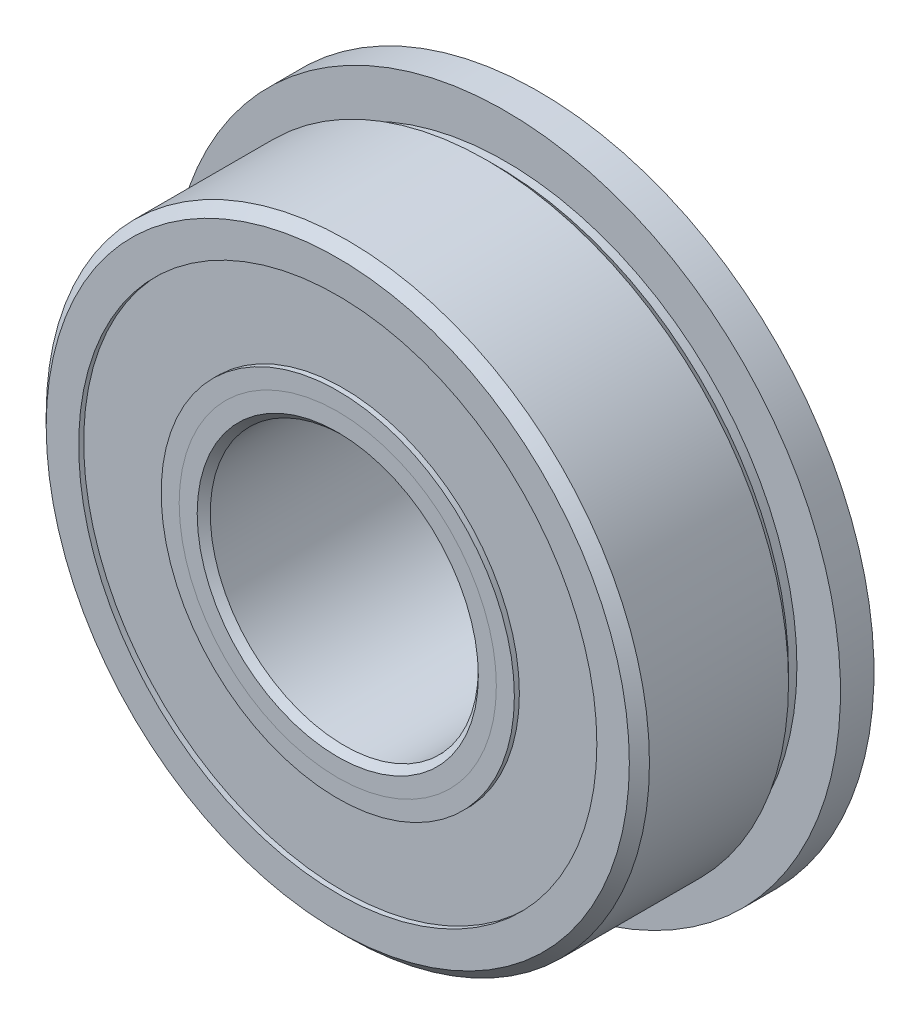
ISO-10303-21;
HEADER;
FILE_DESCRIPTION(('STEP AP214'),'2;1');
FILE_NAME('part.step','',(''),(''),'','','');
FILE_SCHEMA(('AUTOMOTIVE_DESIGN { 1 0 10303 214 1 1 1 1 }'));
ENDSEC;
DATA;
#1=APPLICATION_CONTEXT('core data for automotive mechanical design processes');
#2=APPLICATION_PROTOCOL_DEFINITION('international standard','automotive_design',2000,#1);
#3=PRODUCT_CONTEXT('',#1,'mechanical');
#4=PRODUCT('Part','Part','',(#3));
#5=PRODUCT_RELATED_PRODUCT_CATEGORY('part','',(#4));
#6=PRODUCT_DEFINITION_FORMATION('','',#4);
#7=PRODUCT_DEFINITION_CONTEXT('part definition',#1,'design');
#8=PRODUCT_DEFINITION('design','',#6,#7);
#9=PRODUCT_DEFINITION_SHAPE('','',#8);
#10=(LENGTH_UNIT() NAMED_UNIT(*) SI_UNIT(.MILLI.,.METRE.));
#11=(NAMED_UNIT(*) PLANE_ANGLE_UNIT() SI_UNIT($,.RADIAN.));
#12=(NAMED_UNIT(*) SI_UNIT($,.STERADIAN.) SOLID_ANGLE_UNIT());
#13=UNCERTAINTY_MEASURE_WITH_UNIT(LENGTH_MEASURE(1.E-05),#10,'distance_accuracy_value','');
#14=(GEOMETRIC_REPRESENTATION_CONTEXT(3) GLOBAL_UNCERTAINTY_ASSIGNED_CONTEXT((#13)) GLOBAL_UNIT_ASSIGNED_CONTEXT((#10,
#11,#12)) REPRESENTATION_CONTEXT('',''));
#15=CARTESIAN_POINT('',(0.,0.,0.));
#16=DIRECTION('',(0.,0.,1.));
#17=DIRECTION('',(1.,0.,0.));
#18=AXIS2_PLACEMENT_3D('',#15,#16,#17);
#19=CARTESIAN_POINT('',(0.,0.,4.7625));
#20=DIRECTION('',(0.,0.,1.));
#21=DIRECTION('',(1.,0.,0.));
#22=AXIS2_PLACEMENT_3D('',#19,#20,#21);
#23=CYLINDRICAL_SURFACE('',#22,8.7376);
#24=CARTESIAN_POINT('',(0.,0.,-3.35017734788581));
#25=DIRECTION('',(0.,0.,1.));
#26=DIRECTION('',(1.,0.,0.));
#27=AXIS2_PLACEMENT_3D('',#24,#25,#26);
#28=CIRCLE('',#27,8.7376);
#29=CARTESIAN_POINT('',(8.7376,0.,-3.35017734788581));
#30=VERTEX_POINT('',#29);
#31=EDGE_CURVE('E11',#30,#30,#28,.T.);
#32=ORIENTED_EDGE('',*,*,#31,.T.);
#33=EDGE_LOOP('',(#32));
#34=FACE_BOUND('',#33,.T.);
#35=CARTESIAN_POINT('',(0.,0.,-4.270375));
#36=DIRECTION('',(0.,0.,-1.));
#37=DIRECTION('',(-1.,0.,0.));
#38=AXIS2_PLACEMENT_3D('',#35,#36,#37);
#39=CIRCLE('',#38,8.7376);
#40=CARTESIAN_POINT('',(-8.7376,0.,-4.270375));
#41=VERTEX_POINT('',#40);
#42=EDGE_CURVE('E71',#41,#41,#39,.T.);
#43=ORIENTED_EDGE('',*,*,#42,.T.);
#44=EDGE_LOOP('',(#43));
#45=FACE_BOUND('',#44,.T.);
#46=ADVANCED_FACE('F50',(#34,#45),#23,.F.);
#47=CARTESIAN_POINT('',(0.,12.2725961538462,-4.524375));
#48=DIRECTION('',(0.,0.,1.));
#49=DIRECTION('',(1.,0.,0.));
#50=AXIS2_PLACEMENT_3D('',#47,#48,#49);
#51=PLANE('',#50);
#52=CARTESIAN_POINT('',(0.,0.,-4.524375));
#53=DIRECTION('',(0.,0.,-1.));
#54=DIRECTION('',(-1.,0.,0.));
#55=AXIS2_PLACEMENT_3D('',#52,#53,#54);
#56=CIRCLE('',#55,9.436608);
#57=CARTESIAN_POINT('',(-9.436608,0.,-4.524375));
#58=VERTEX_POINT('',#57);
#59=EDGE_CURVE('E68',#58,#58,#56,.T.);
#60=ORIENTED_EDGE('',*,*,#59,.F.);
#61=EDGE_LOOP('',(#60));
#62=FACE_BOUND('',#61,.T.);
#63=CARTESIAN_POINT('',(0.,0.,-4.524375));
#64=DIRECTION('',(0.,0.,1.));
#65=DIRECTION('',(1.,0.,0.));
#66=AXIS2_PLACEMENT_3D('',#63,#64,#65);
#67=CIRCLE('',#66,12.2725961538462);
#68=CARTESIAN_POINT('',(12.2725961538462,0.,-4.524375));
#69=VERTEX_POINT('',#68);
#70=EDGE_CURVE('E61',#69,#69,#67,.T.);
#71=ORIENTED_EDGE('',*,*,#70,.F.);
#72=EDGE_LOOP('',(#71));
#73=FACE_BOUND('',#72,.T.);
#74=ADVANCED_FACE('F52',(#62,#73),#51,.F.);
#75=CARTESIAN_POINT('',(0.,12.2725961538462,-3.35017734788581));
#76=DIRECTION('',(0.,0.,-1.));
#77=DIRECTION('',(-1.,0.,0.));
#78=AXIS2_PLACEMENT_3D('',#75,#76,#77);
#79=PLANE('',#78);
#80=ORIENTED_EDGE('',*,*,#31,.F.);
#81=EDGE_LOOP('',(#80));
#82=FACE_BOUND('',#81,.T.);
#83=CARTESIAN_POINT('',(0.,0.,-3.35017734788581));
#84=DIRECTION('',(0.,0.,1.));
#85=DIRECTION('',(1.,0.,0.));
#86=AXIS2_PLACEMENT_3D('',#83,#84,#85);
#87=CIRCLE('',#86,12.2725961538462);
#88=CARTESIAN_POINT('',(12.2725961538462,0.,-3.35017734788581));
#89=VERTEX_POINT('',#88);
#90=EDGE_CURVE('E57',#89,#89,#87,.T.);
#91=ORIENTED_EDGE('',*,*,#90,.T.);
#92=EDGE_LOOP('',(#91));
#93=FACE_BOUND('',#92,.T.);
#94=ADVANCED_FACE('F93',(#82,#93),#79,.F.);
#95=CARTESIAN_POINT('',(0.,0.,4.7625));
#96=DIRECTION('',(0.,0.,1.));
#97=DIRECTION('',(1.,0.,0.));
#98=AXIS2_PLACEMENT_3D('',#95,#96,#97);
#99=CYLINDRICAL_SURFACE('',#98,12.2725961538462);
#100=ORIENTED_EDGE('',*,*,#90,.F.);
#101=EDGE_LOOP('',(#100));
#102=FACE_BOUND('',#101,.T.);
#103=ORIENTED_EDGE('',*,*,#70,.T.);
#104=EDGE_LOOP('',(#103));
#105=FACE_BOUND('',#104,.T.);
#106=ADVANCED_FACE('F87',(#102,#105),#99,.T.);
#107=CARTESIAN_POINT('',(0.,0.,-4.270375));
#108=DIRECTION('',(0.,0.,-1.));
#109=DIRECTION('',(-1.,0.,0.));
#110=AXIS2_PLACEMENT_3D('',#107,#108,#109);
#111=CYLINDRICAL_SURFACE('',#110,9.436608);
#112=CARTESIAN_POINT('',(0.,0.,-4.270375));
#113=DIRECTION('',(0.,0.,-1.));
#114=DIRECTION('',(-1.,0.,0.));
#115=AXIS2_PLACEMENT_3D('',#112,#113,#114);
#116=CIRCLE('',#115,9.436608);
#117=CARTESIAN_POINT('',(-9.436608,0.,-4.270375));
#118=VERTEX_POINT('',#117);
#119=EDGE_CURVE('E65',#118,#118,#116,.T.);
#120=ORIENTED_EDGE('',*,*,#119,.F.);
#121=EDGE_LOOP('',(#120));
#122=FACE_BOUND('',#121,.T.);
#123=ORIENTED_EDGE('',*,*,#59,.T.);
#124=EDGE_LOOP('',(#123));
#125=FACE_BOUND('',#124,.T.);
#126=ADVANCED_FACE('F81',(#122,#125),#111,.F.);
#127=CARTESIAN_POINT('',(0.,0.,-4.270375));
#128=DIRECTION('',(0.,0.,-1.));
#129=DIRECTION('',(-1.,0.,0.));
#130=AXIS2_PLACEMENT_3D('',#127,#128,#129);
#131=PLANE('',#130);
#132=ORIENTED_EDGE('',*,*,#42,.F.);
#133=EDGE_LOOP('',(#132));
#134=FACE_BOUND('',#133,.T.);
#135=ORIENTED_EDGE('',*,*,#119,.T.);
#136=EDGE_LOOP('',(#135));
#137=FACE_BOUND('',#136,.T.);
#138=ADVANCED_FACE('F78',(#134,#137),#131,.T.);
#139=CLOSED_SHELL('',(#46,#74,#94,#106,#126,#138));
#140=MANIFOLD_SOLID_BREP('B2',#139);
#141=CARTESIAN_POINT('',(0.,12.2725961538462,4.524375));
#142=DIRECTION('',(0.,0.,-1.));
#143=DIRECTION('',(-1.,0.,0.));
#144=AXIS2_PLACEMENT_3D('',#141,#142,#143);
#145=PLANE('',#144);
#146=CARTESIAN_POINT('',(0.,0.,4.524375));
#147=DIRECTION('',(0.,0.,1.));
#148=DIRECTION('',(1.,0.,0.));
#149=AXIS2_PLACEMENT_3D('',#146,#147,#148);
#150=CIRCLE('',#149,8.36490384615385);
#151=CARTESIAN_POINT('',(8.36490384615385,0.,4.524375));
#152=VERTEX_POINT('',#151);
#153=EDGE_CURVE('E49',#152,#152,#150,.T.);
#154=ORIENTED_EDGE('',*,*,#153,.F.);
#155=EDGE_LOOP('',(#154));
#156=FACE_BOUND('',#155,.T.);
#157=CARTESIAN_POINT('',(0.,0.,4.524375));
#158=DIRECTION('',(0.,0.,1.));
#159=DIRECTION('',(1.,0.,0.));
#160=AXIS2_PLACEMENT_3D('',#157,#158,#159);
#161=CIRCLE('',#160,12.2725961538462);
#162=CARTESIAN_POINT('',(12.2725961538462,0.,4.524375));
#163=VERTEX_POINT('',#162);
#164=EDGE_CURVE('E168',#163,#163,#161,.T.);
#165=ORIENTED_EDGE('',*,*,#164,.T.);
#166=EDGE_LOOP('',(#165));
#167=FACE_BOUND('',#166,.T.);
#168=ADVANCED_FACE('F154',(#156,#167),#145,.F.);
#169=CARTESIAN_POINT('',(0.,0.,4.7625));
#170=DIRECTION('',(0.,0.,1.));
#171=DIRECTION('',(1.,0.,0.));
#172=AXIS2_PLACEMENT_3D('',#169,#170,#171);
#173=CYLINDRICAL_SURFACE('',#172,8.36490384615385);
#174=CARTESIAN_POINT('',(0.,0.,3.3501773478858));
#175=DIRECTION('',(0.,0.,1.));
#176=DIRECTION('',(1.,0.,0.));
#177=AXIS2_PLACEMENT_3D('',#174,#175,#176);
#178=CIRCLE('',#177,8.36490384615385);
#179=CARTESIAN_POINT('',(8.36490384615385,0.,3.3501773478858));
#180=VERTEX_POINT('',#179);
#181=EDGE_CURVE('E160',#180,#180,#178,.T.);
#182=ORIENTED_EDGE('',*,*,#181,.F.);
#183=EDGE_LOOP('',(#182));
#184=FACE_BOUND('',#183,.T.);
#185=ORIENTED_EDGE('',*,*,#153,.T.);
#186=EDGE_LOOP('',(#185));
#187=FACE_BOUND('',#186,.T.);
#188=ADVANCED_FACE('F183',(#184,#187),#173,.F.);
#189=CARTESIAN_POINT('',(0.,12.2725961538462,3.3501773478858));
#190=DIRECTION('',(0.,0.,1.));
#191=DIRECTION('',(1.,0.,0.));
#192=AXIS2_PLACEMENT_3D('',#189,#190,#191);
#193=PLANE('',#192);
#194=CARTESIAN_POINT('',(0.,0.,3.35017734788581));
#195=DIRECTION('',(0.,0.,1.));
#196=DIRECTION('',(1.,0.,0.));
#197=AXIS2_PLACEMENT_3D('',#194,#195,#196);
#198=CIRCLE('',#197,12.2725961538462);
#199=CARTESIAN_POINT('',(12.2725961538462,0.,3.35017734788581));
#200=VERTEX_POINT('',#199);
#201=EDGE_CURVE('E164',#200,#200,#198,.T.);
#202=ORIENTED_EDGE('',*,*,#201,.F.);
#203=EDGE_LOOP('',(#202));
#204=FACE_BOUND('',#203,.T.);
#205=ORIENTED_EDGE('',*,*,#181,.T.);
#206=EDGE_LOOP('',(#205));
#207=FACE_BOUND('',#206,.T.);
#208=ADVANCED_FACE('F178',(#204,#207),#193,.F.);
#209=CARTESIAN_POINT('',(0.,0.,4.7625));
#210=DIRECTION('',(0.,0.,1.));
#211=DIRECTION('',(1.,0.,0.));
#212=AXIS2_PLACEMENT_3D('',#209,#210,#211);
#213=CYLINDRICAL_SURFACE('',#212,12.2725961538462);
#214=ORIENTED_EDGE('',*,*,#164,.F.);
#215=EDGE_LOOP('',(#214));
#216=FACE_BOUND('',#215,.T.);
#217=ORIENTED_EDGE('',*,*,#201,.T.);
#218=EDGE_LOOP('',(#217));
#219=FACE_BOUND('',#218,.T.);
#220=ADVANCED_FACE('F175',(#216,#219),#213,.T.);
#221=CLOSED_SHELL('',(#168,#188,#208,#220));
#222=MANIFOLD_SOLID_BREP('B6',#221);
#223=CARTESIAN_POINT('',(-5.15937499999989,8.93629963530074,0.));
#224=DIRECTION('',(0.,0.,1.));
#225=DIRECTION('',(-0.499999999999989,0.866025403784445,0.));
#226=AXIS2_PLACEMENT_3D('',#223,#224,#225);
#227=SPHERICAL_SURFACE('',#226,3.3501773478858);
#228=CARTESIAN_POINT('',(-5.15937499999989,8.93629963530074,3.3501773478858));
#229=VERTEX_POINT('',#228);
#230=VERTEX_LOOP('',#229);
#231=FACE_BOUND('',#230,.T.);
#232=ADVANCED_FACE('F214',(#231),#227,.T.);
#233=CLOSED_SHELL('',(#232));
#234=MANIFOLD_SOLID_BREP('B44',#233);
#235=CARTESIAN_POINT('',(-8.93629963530062,5.1593750000001,0.));
#236=DIRECTION('',(0.,0.,1.));
#237=DIRECTION('',(-0.866025403784433,0.50000000000001,0.));
#238=AXIS2_PLACEMENT_3D('',#235,#236,#237);
#239=SPHERICAL_SURFACE('',#238,3.3501773478858);
#240=CARTESIAN_POINT('',(-8.93629963530062,5.1593750000001,3.3501773478858));
#241=VERTEX_POINT('',#240);
#242=VERTEX_LOOP('',#241);
#243=FACE_BOUND('',#242,.T.);
#244=ADVANCED_FACE('F233',(#243),#239,.T.);
#245=CLOSED_SHELL('',(#244));
#246=MANIFOLD_SOLID_BREP('B150',#245);
#247=CARTESIAN_POINT('',(-10.31875,1.08083169195563E-13,0.));
#248=DIRECTION('',(0.,0.,1.));
#249=DIRECTION('',(-1.,0.,0.));
#250=AXIS2_PLACEMENT_3D('',#247,#248,#249);
#251=SPHERICAL_SURFACE('',#250,3.3501773478858);
#252=CARTESIAN_POINT('',(-10.31875,1.08083169195563E-13,3.3501773478858));
#253=VERTEX_POINT('',#252);
#254=VERTEX_LOOP('',#253);
#255=FACE_BOUND('',#254,.T.);
#256=ADVANCED_FACE('F252',(#255),#251,.T.);
#257=CLOSED_SHELL('',(#256));
#258=MANIFOLD_SOLID_BREP('B210',#257);
#259=CARTESIAN_POINT('',(-8.93629963530072,-5.15937499999992,0.));
#260=DIRECTION('',(0.,0.,1.));
#261=DIRECTION('',(-0.866025403784443,-0.499999999999992,0.));
#262=AXIS2_PLACEMENT_3D('',#259,#260,#261);
#263=SPHERICAL_SURFACE('',#262,3.3501773478858);
#264=CARTESIAN_POINT('',(-8.93629963530072,-5.15937499999992,3.3501773478858));
#265=VERTEX_POINT('',#264);
#266=VERTEX_LOOP('',#265);
#267=FACE_BOUND('',#266,.T.);
#268=ADVANCED_FACE('F271',(#267),#263,.T.);
#269=CLOSED_SHELL('',(#268));
#270=MANIFOLD_SOLID_BREP('B229',#269);
#271=CARTESIAN_POINT('',(-5.15937500000007,-8.93629963530064,0.));
#272=DIRECTION('',(0.,0.,1.));
#273=DIRECTION('',(-0.500000000000007,-0.866025403784435,0.));
#274=AXIS2_PLACEMENT_3D('',#271,#272,#273);
#275=SPHERICAL_SURFACE('',#274,3.3501773478858);
#276=CARTESIAN_POINT('',(-5.15937500000007,-8.93629963530064,3.3501773478858));
#277=VERTEX_POINT('',#276);
#278=VERTEX_LOOP('',#277);
#279=FACE_BOUND('',#278,.T.);
#280=ADVANCED_FACE('F290',(#279),#275,.T.);
#281=CLOSED_SHELL('',(#280));
#282=MANIFOLD_SOLID_BREP('B248',#281);
#283=CARTESIAN_POINT('',(0.,-10.31875,0.));
#284=DIRECTION('',(0.,0.,1.));
#285=DIRECTION('',(0.,-1.,0.));
#286=AXIS2_PLACEMENT_3D('',#283,#284,#285);
#287=SPHERICAL_SURFACE('',#286,3.3501773478858);
#288=CARTESIAN_POINT('',(0.,-10.31875,3.3501773478858));
#289=VERTEX_POINT('',#288);
#290=VERTEX_LOOP('',#289);
#291=FACE_BOUND('',#290,.T.);
#292=ADVANCED_FACE('F309',(#291),#287,.T.);
#293=CLOSED_SHELL('',(#292));
#294=MANIFOLD_SOLID_BREP('B267',#293);
#295=CARTESIAN_POINT('',(5.15937499999995,-8.93629963530071,0.));
#296=DIRECTION('',(0.,0.,1.));
#297=DIRECTION('',(0.499999999999995,-0.866025403784442,0.));
#298=AXIS2_PLACEMENT_3D('',#295,#296,#297);
#299=SPHERICAL_SURFACE('',#298,3.3501773478858);
#300=CARTESIAN_POINT('',(5.15937499999995,-8.93629963530071,3.3501773478858));
#301=VERTEX_POINT('',#300);
#302=VERTEX_LOOP('',#301);
#303=FACE_BOUND('',#302,.T.);
#304=ADVANCED_FACE('F328',(#303),#299,.T.);
#305=CLOSED_SHELL('',(#304));
#306=MANIFOLD_SOLID_BREP('B286',#305);
#307=CARTESIAN_POINT('',(8.93629963530065,-5.15937500000004,0.));
#308=DIRECTION('',(0.,0.,1.));
#309=DIRECTION('',(0.866025403784436,-0.500000000000004,0.));
#310=AXIS2_PLACEMENT_3D('',#307,#308,#309);
#311=SPHERICAL_SURFACE('',#310,3.3501773478858);
#312=CARTESIAN_POINT('',(8.93629963530065,-5.15937500000004,3.3501773478858));
#313=VERTEX_POINT('',#312);
#314=VERTEX_LOOP('',#313);
#315=FACE_BOUND('',#314,.T.);
#316=ADVANCED_FACE('F347',(#315),#311,.T.);
#317=CLOSED_SHELL('',(#316));
#318=MANIFOLD_SOLID_BREP('B305',#317);
#319=CARTESIAN_POINT('',(10.31875,0.,0.));
#320=DIRECTION('',(0.,0.,1.));
#321=DIRECTION('',(1.,0.,0.));
#322=AXIS2_PLACEMENT_3D('',#319,#320,#321);
#323=SPHERICAL_SURFACE('',#322,3.3501773478858);
#324=CARTESIAN_POINT('',(10.31875,0.,3.3501773478858));
#325=VERTEX_POINT('',#324);
#326=VERTEX_LOOP('',#325);
#327=FACE_BOUND('',#326,.T.);
#328=ADVANCED_FACE('F366',(#327),#323,.T.);
#329=CLOSED_SHELL('',(#328));
#330=MANIFOLD_SOLID_BREP('B324',#329);
#331=CARTESIAN_POINT('',(8.93629963530069,5.15937499999998,0.));
#332=DIRECTION('',(0.,0.,1.));
#333=DIRECTION('',(0.86602540378444,0.499999999999998,0.));
#334=AXIS2_PLACEMENT_3D('',#331,#332,#333);
#335=SPHERICAL_SURFACE('',#334,3.3501773478858);
#336=CARTESIAN_POINT('',(8.93629963530069,5.15937499999998,3.3501773478858));
#337=VERTEX_POINT('',#336);
#338=VERTEX_LOOP('',#337);
#339=FACE_BOUND('',#338,.T.);
#340=ADVANCED_FACE('F385',(#339),#335,.T.);
#341=CLOSED_SHELL('',(#340));
#342=MANIFOLD_SOLID_BREP('B343',#341);
#343=CARTESIAN_POINT('',(5.15937500000001,8.93629963530067,0.));
#344=DIRECTION('',(0.,0.,1.));
#345=DIRECTION('',(0.500000000000001,0.866025403784438,0.));
#346=AXIS2_PLACEMENT_3D('',#343,#344,#345);
#347=SPHERICAL_SURFACE('',#346,3.3501773478858);
#348=CARTESIAN_POINT('',(5.15937500000001,8.93629963530067,3.3501773478858));
#349=VERTEX_POINT('',#348);
#350=VERTEX_LOOP('',#349);
#351=FACE_BOUND('',#350,.T.);
#352=ADVANCED_FACE('F404',(#351),#347,.T.);
#353=CLOSED_SHELL('',(#352));
#354=MANIFOLD_SOLID_BREP('B362',#353);
#355=CARTESIAN_POINT('',(0.,10.31875,0.));
#356=DIRECTION('',(0.,0.,1.));
#357=DIRECTION('',(0.,1.,0.));
#358=AXIS2_PLACEMENT_3D('',#355,#356,#357);
#359=SPHERICAL_SURFACE('',#358,3.3501773478858);
#360=CARTESIAN_POINT('',(0.,10.31875,3.3501773478858));
#361=VERTEX_POINT('',#360);
#362=VERTEX_LOOP('',#361);
#363=FACE_BOUND('',#362,.T.);
#364=ADVANCED_FACE('F425',(#363),#359,.T.);
#365=CLOSED_SHELL('',(#364));
#366=MANIFOLD_SOLID_BREP('B381',#365);
#367=CARTESIAN_POINT('',(0.,6.82625,-6.35));
#368=DIRECTION('',(0.,0.,1.));
#369=DIRECTION('',(1.,0.,0.));
#370=AXIS2_PLACEMENT_3D('',#367,#368,#369);
#371=PLANE('',#370);
#372=CARTESIAN_POINT('',(0.,0.,-6.35));
#373=DIRECTION('',(0.,0.,1.));
#374=DIRECTION('',(1.,0.,0.));
#375=AXIS2_PLACEMENT_3D('',#372,#373,#374);
#376=CIRCLE('',#375,6.82625);
#377=CARTESIAN_POINT('',(6.82625,0.,-6.35));
#378=VERTEX_POINT('',#377);
#379=EDGE_CURVE('E470',#378,#378,#376,.T.);
#380=ORIENTED_EDGE('',*,*,#379,.T.);
#381=EDGE_LOOP('',(#380));
#382=FACE_BOUND('',#381,.T.);
#383=CARTESIAN_POINT('',(0.,0.,-6.35));
#384=DIRECTION('',(0.,0.,-1.));
#385=DIRECTION('',(-1.,0.,0.));
#386=AXIS2_PLACEMENT_3D('',#383,#384,#385);
#387=CIRCLE('',#386,7.607173);
#388=CARTESIAN_POINT('',(-7.607173,0.,-6.35));
#389=VERTEX_POINT('',#388);
#390=EDGE_CURVE('E489',#389,#389,#387,.T.);
#391=ORIENTED_EDGE('',*,*,#390,.T.);
#392=EDGE_LOOP('',(#391));
#393=FACE_BOUND('',#392,.T.);
#394=ADVANCED_FACE('F444',(#382,#393),#371,.F.);
#395=CARTESIAN_POINT('',(0.,7.51209508610547,4.7625));
#396=DIRECTION('',(0.,0.,-1.));
#397=DIRECTION('',(-1.,0.,0.));
#398=AXIS2_PLACEMENT_3D('',#395,#396,#397);
#399=PLANE('',#398);
#400=CARTESIAN_POINT('',(0.,0.,4.7625));
#401=DIRECTION('',(0.,0.,1.));
#402=DIRECTION('',(1.,0.,0.));
#403=AXIS2_PLACEMENT_3D('',#400,#401,#402);
#404=CIRCLE('',#403,6.6592863260571);
#405=CARTESIAN_POINT('',(6.6592863260571,0.,4.7625));
#406=VERTEX_POINT('',#405);
#407=EDGE_CURVE('E479',#406,#406,#404,.T.);
#408=ORIENTED_EDGE('',*,*,#407,.F.);
#409=EDGE_LOOP('',(#408));
#410=FACE_BOUND('',#409,.T.);
#411=CARTESIAN_POINT('',(0.,0.,4.7625));
#412=DIRECTION('',(0.,0.,1.));
#413=DIRECTION('',(1.,0.,0.));
#414=AXIS2_PLACEMENT_3D('',#411,#412,#413);
#415=CIRCLE('',#414,7.51209508610547);
#416=CARTESIAN_POINT('',(7.51209508610547,0.,4.7625));
#417=VERTEX_POINT('',#416);
#418=EDGE_CURVE('E424',#417,#417,#415,.T.);
#419=ORIENTED_EDGE('',*,*,#418,.T.);
#420=EDGE_LOOP('',(#419));
#421=FACE_BOUND('',#420,.T.);
#422=ADVANCED_FACE('F446',(#410,#421),#399,.F.);
#423=CARTESIAN_POINT('',(0.,0.,3.90969123995163));
#424=DIRECTION('',(0.,0.,1.));
#425=DIRECTION('',(1.,0.,0.));
#426=AXIS2_PLACEMENT_3D('',#423,#424,#425);
#427=CONICAL_SURFACE('',#426,6.6592863260571,0.785398163397449);
#428=ORIENTED_EDGE('',*,*,#418,.F.);
#429=EDGE_LOOP('',(#428));
#430=FACE_BOUND('',#429,.T.);
#431=CARTESIAN_POINT('',(0.,0.,3.90969123995163));
#432=DIRECTION('',(0.,0.,1.));
#433=DIRECTION('',(1.,0.,0.));
#434=AXIS2_PLACEMENT_3D('',#431,#432,#433);
#435=CIRCLE('',#434,6.6592863260571);
#436=CARTESIAN_POINT('',(6.6592863260571,0.,3.90969123995163));
#437=VERTEX_POINT('',#436);
#438=EDGE_CURVE('E451',#437,#437,#435,.T.);
#439=ORIENTED_EDGE('',*,*,#438,.T.);
#440=EDGE_LOOP('',(#439));
#441=FACE_BOUND('',#440,.T.);
#442=ADVANCED_FACE('F537',(#430,#441),#427,.T.);
#443=CARTESIAN_POINT('',(0.,0.,4.7625));
#444=DIRECTION('',(0.,0.,1.));
#445=DIRECTION('',(1.,0.,0.));
#446=AXIS2_PLACEMENT_3D('',#443,#444,#445);
#447=CYLINDRICAL_SURFACE('',#446,6.6592863260571);
#448=ORIENTED_EDGE('',*,*,#438,.F.);
#449=EDGE_LOOP('',(#448));
#450=FACE_BOUND('',#449,.T.);
#451=CARTESIAN_POINT('',(0.,0.,0.));
#452=DIRECTION('',(0.,0.,1.));
#453=DIRECTION('',(1.,0.,0.));
#454=AXIS2_PLACEMENT_3D('',#451,#452,#453);
#455=CIRCLE('',#454,6.6592863260571);
#456=CARTESIAN_POINT('',(6.6592863260571,0.,0.));
#457=VERTEX_POINT('',#456);
#458=EDGE_CURVE('E455',#457,#457,#455,.T.);
#459=ORIENTED_EDGE('',*,*,#458,.T.);
#460=EDGE_LOOP('',(#459));
#461=FACE_BOUND('',#460,.T.);
#462=ADVANCED_FACE('F591',(#450,#461),#447,.T.);
#463=CARTESIAN_POINT('',(0.,6.6592863260571,0.));
#464=DIRECTION('',(0.,0.,-1.));
#465=DIRECTION('',(-1.,0.,0.));
#466=AXIS2_PLACEMENT_3D('',#463,#464,#465);
#467=PLANE('',#466);
#468=ORIENTED_EDGE('',*,*,#458,.F.);
#469=EDGE_LOOP('',(#468));
#470=FACE_BOUND('',#469,.T.);
#471=CARTESIAN_POINT('',(0.,0.,0.));
#472=DIRECTION('',(0.,0.,1.));
#473=DIRECTION('',(1.,0.,0.));
#474=AXIS2_PLACEMENT_3D('',#471,#472,#473);
#475=CIRCLE('',#474,6.9685726521142);
#476=CARTESIAN_POINT('',(6.9685726521142,0.,0.));
#477=VERTEX_POINT('',#476);
#478=EDGE_CURVE('E459',#477,#477,#475,.T.);
#479=ORIENTED_EDGE('',*,*,#478,.T.);
#480=EDGE_LOOP('',(#479));
#481=FACE_BOUND('',#480,.T.);
#482=ADVANCED_FACE('F527',(#470,#481),#467,.F.);
#483=CARTESIAN_POINT('',(0.,0.,0.));
#484=DIRECTION('',(0.,0.,1.));
#485=DIRECTION('',(1.,0.,0.));
#486=AXIS2_PLACEMENT_3D('',#483,#484,#485);
#487=TOROIDAL_SURFACE('',#486,10.31875,3.3501773478858);
#488=ORIENTED_EDGE('',*,*,#478,.F.);
#489=EDGE_LOOP('',(#488));
#490=FACE_BOUND('',#489,.T.);
#491=CARTESIAN_POINT('',(0.,0.,-2.9535830680357));
#492=DIRECTION('',(0.,0.,1.));
#493=DIRECTION('',(1.,0.,0.));
#494=AXIS2_PLACEMENT_3D('',#491,#492,#493);
#495=CIRCLE('',#494,8.7376);
#496=CARTESIAN_POINT('',(8.7376,0.,-2.9535830680357));
#497=VERTEX_POINT('',#496);
#498=EDGE_CURVE('E464',#497,#497,#495,.T.);
#499=ORIENTED_EDGE('',*,*,#498,.T.);
#500=EDGE_LOOP('',(#499));
#501=FACE_BOUND('',#500,.T.);
#502=ADVANCED_FACE('F520',(#490,#501),#487,.F.);
#503=CARTESIAN_POINT('',(0.,0.,4.7625));
#504=DIRECTION('',(0.,0.,1.));
#505=DIRECTION('',(1.,0.,0.));
#506=AXIS2_PLACEMENT_3D('',#503,#504,#505);
#507=CYLINDRICAL_SURFACE('',#506,8.7376);
#508=ORIENTED_EDGE('',*,*,#498,.F.);
#509=EDGE_LOOP('',(#508));
#510=FACE_BOUND('',#509,.T.);
#511=CARTESIAN_POINT('',(0.,0.,-6.35));
#512=DIRECTION('',(0.,0.,1.));
#513=DIRECTION('',(1.,0.,0.));
#514=AXIS2_PLACEMENT_3D('',#511,#512,#513);
#515=CIRCLE('',#514,8.7376);
#516=CARTESIAN_POINT('',(8.7376,0.,-6.35));
#517=VERTEX_POINT('',#516);
#518=EDGE_CURVE('E467',#517,#517,#515,.T.);
#519=ORIENTED_EDGE('',*,*,#518,.T.);
#520=EDGE_LOOP('',(#519));
#521=FACE_BOUND('',#520,.T.);
#522=ADVANCED_FACE('F515',(#510,#521),#507,.T.);
#523=CARTESIAN_POINT('',(0.,0.,-6.35));
#524=DIRECTION('',(0.,0.,-1.));
#525=DIRECTION('',(-1.,0.,0.));
#526=AXIS2_PLACEMENT_3D('',#523,#524,#525);
#527=CIRCLE('',#526,7.956677);
#528=CARTESIAN_POINT('',(-7.956677,0.,-6.35));
#529=VERTEX_POINT('',#528);
#530=EDGE_CURVE('E483',#529,#529,#527,.T.);
#531=ORIENTED_EDGE('',*,*,#530,.F.);
#532=EDGE_LOOP('',(#531));
#533=FACE_BOUND('',#532,.T.);
#534=ORIENTED_EDGE('',*,*,#518,.F.);
#535=EDGE_LOOP('',(#534));
#536=FACE_BOUND('',#535,.T.);
#537=ADVANCED_FACE('F511',(#533,#536),#371,.F.);
#538=CARTESIAN_POINT('',(0.,0.,-5.87375));
#539=DIRECTION('',(0.,0.,-1.));
#540=DIRECTION('',(-1.,0.,0.));
#541=AXIS2_PLACEMENT_3D('',#538,#539,#540);
#542=CONICAL_SURFACE('',#541,6.35,0.785398163397445);
#543=ORIENTED_EDGE('',*,*,#379,.F.);
#544=EDGE_LOOP('',(#543));
#545=FACE_BOUND('',#544,.T.);
#546=CARTESIAN_POINT('',(0.,0.,-5.87375));
#547=DIRECTION('',(0.,0.,1.));
#548=DIRECTION('',(1.,0.,0.));
#549=AXIS2_PLACEMENT_3D('',#546,#547,#548);
#550=CIRCLE('',#549,6.35);
#551=CARTESIAN_POINT('',(6.35,0.,-5.87375));
#552=VERTEX_POINT('',#551);
#553=EDGE_CURVE('E473',#552,#552,#550,.T.);
#554=ORIENTED_EDGE('',*,*,#553,.T.);
#555=EDGE_LOOP('',(#554));
#556=FACE_BOUND('',#555,.T.);
#557=ADVANCED_FACE('F514',(#545,#556),#542,.F.);
#558=CARTESIAN_POINT('',(0.,0.,4.7625));
#559=DIRECTION('',(0.,0.,1.));
#560=DIRECTION('',(1.,0.,0.));
#561=AXIS2_PLACEMENT_3D('',#558,#559,#560);
#562=CYLINDRICAL_SURFACE('',#561,6.35);
#563=ORIENTED_EDGE('',*,*,#553,.F.);
#564=EDGE_LOOP('',(#563));
#565=FACE_BOUND('',#564,.T.);
#566=CARTESIAN_POINT('',(0.,0.,4.4532136739429));
#567=DIRECTION('',(0.,0.,1.));
#568=DIRECTION('',(1.,0.,0.));
#569=AXIS2_PLACEMENT_3D('',#566,#567,#568);
#570=CIRCLE('',#569,6.35);
#571=CARTESIAN_POINT('',(6.35,0.,4.4532136739429));
#572=VERTEX_POINT('',#571);
#573=EDGE_CURVE('E476',#572,#572,#570,.T.);
#574=ORIENTED_EDGE('',*,*,#573,.T.);
#575=EDGE_LOOP('',(#574));
#576=FACE_BOUND('',#575,.T.);
#577=ADVANCED_FACE('F542',(#565,#576),#562,.F.);
#578=CARTESIAN_POINT('',(0.,0.,4.7625));
#579=DIRECTION('',(0.,0.,1.));
#580=DIRECTION('',(1.,0.,0.));
#581=AXIS2_PLACEMENT_3D('',#578,#579,#580);
#582=CONICAL_SURFACE('',#581,6.6592863260571,0.78539816339745);
#583=ORIENTED_EDGE('',*,*,#573,.F.);
#584=EDGE_LOOP('',(#583));
#585=FACE_BOUND('',#584,.T.);
#586=ORIENTED_EDGE('',*,*,#407,.T.);
#587=EDGE_LOOP('',(#586));
#588=FACE_BOUND('',#587,.T.);
#589=ADVANCED_FACE('F507',(#585,#588),#582,.F.);
#590=CARTESIAN_POINT('',(0.,0.,-6.223));
#591=DIRECTION('',(0.,0.,-1.));
#592=DIRECTION('',(-1.,0.,0.));
#593=AXIS2_PLACEMENT_3D('',#590,#591,#592);
#594=CYLINDRICAL_SURFACE('',#593,7.956677);
#595=CARTESIAN_POINT('',(0.,0.,-6.223));
#596=DIRECTION('',(0.,0.,-1.));
#597=DIRECTION('',(-1.,0.,0.));
#598=AXIS2_PLACEMENT_3D('',#595,#596,#597);
#599=CIRCLE('',#598,7.956677);
#600=CARTESIAN_POINT('',(-7.956677,0.,-6.223));
#601=VERTEX_POINT('',#600);
#602=EDGE_CURVE('E482',#601,#601,#599,.T.);
#603=ORIENTED_EDGE('',*,*,#602,.F.);
#604=EDGE_LOOP('',(#603));
#605=FACE_BOUND('',#604,.T.);
#606=ORIENTED_EDGE('',*,*,#530,.T.);
#607=EDGE_LOOP('',(#606));
#608=FACE_BOUND('',#607,.T.);
#609=ADVANCED_FACE('F501',(#605,#608),#594,.F.);
#610=CARTESIAN_POINT('',(0.,0.,-6.223));
#611=DIRECTION('',(0.,0.,-1.));
#612=DIRECTION('',(-1.,0.,0.));
#613=AXIS2_PLACEMENT_3D('',#610,#611,#612);
#614=PLANE('',#613);
#615=CARTESIAN_POINT('',(0.,0.,-6.223));
#616=DIRECTION('',(0.,0.,-1.));
#617=DIRECTION('',(-1.,0.,0.));
#618=AXIS2_PLACEMENT_3D('',#615,#616,#617);
#619=CIRCLE('',#618,7.607173);
#620=CARTESIAN_POINT('',(-7.607173,0.,-6.223));
#621=VERTEX_POINT('',#620);
#622=EDGE_CURVE('E486',#621,#621,#619,.T.);
#623=ORIENTED_EDGE('',*,*,#622,.F.);
#624=EDGE_LOOP('',(#623));
#625=FACE_BOUND('',#624,.T.);
#626=ORIENTED_EDGE('',*,*,#602,.T.);
#627=EDGE_LOOP('',(#626));
#628=FACE_BOUND('',#627,.T.);
#629=ADVANCED_FACE('F498',(#625,#628),#614,.T.);
#630=CARTESIAN_POINT('',(0.,0.,-6.223));
#631=DIRECTION('',(0.,0.,-1.));
#632=DIRECTION('',(-1.,0.,0.));
#633=AXIS2_PLACEMENT_3D('',#630,#631,#632);
#634=CYLINDRICAL_SURFACE('',#633,7.607173);
#635=ORIENTED_EDGE('',*,*,#622,.T.);
#636=EDGE_LOOP('',(#635));
#637=FACE_BOUND('',#636,.T.);
#638=ORIENTED_EDGE('',*,*,#390,.F.);
#639=EDGE_LOOP('',(#638));
#640=FACE_BOUND('',#639,.T.);
#641=ADVANCED_FACE('F495',(#637,#640),#634,.T.);
#642=CLOSED_SHELL('',(#394,#422,#442,#462,#482,#502,#522,#537,#557,#577,#589,#609,#629,#641));
#643=MANIFOLD_SOLID_BREP('B400',#642);
#644=CARTESIAN_POINT('',(0.,8.36490384615385,4.7625));
#645=DIRECTION('',(0.,0.,-1.));
#646=DIRECTION('',(-1.,0.,0.));
#647=AXIS2_PLACEMENT_3D('',#644,#645,#646);
#648=PLANE('',#647);
#649=CARTESIAN_POINT('',(0.,0.,4.7625));
#650=DIRECTION('',(0.,0.,1.));
#651=DIRECTION('',(1.,0.,0.));
#652=AXIS2_PLACEMENT_3D('',#649,#650,#651);
#653=CIRCLE('',#652,7.51209508610547);
#654=CARTESIAN_POINT('',(7.51209508610547,0.,4.7625));
#655=VERTEX_POINT('',#654);
#656=EDGE_CURVE('E443',#655,#655,#653,.T.);
#657=ORIENTED_EDGE('',*,*,#656,.F.);
#658=EDGE_LOOP('',(#657));
#659=FACE_BOUND('',#658,.T.);
#660=CARTESIAN_POINT('',(0.,0.,4.7625));
#661=DIRECTION('',(0.,0.,1.));
#662=DIRECTION('',(1.,0.,0.));
#663=AXIS2_PLACEMENT_3D('',#660,#661,#662);
#664=CIRCLE('',#663,8.36490384615385);
#665=CARTESIAN_POINT('',(8.36490384615385,0.,4.7625));
#666=VERTEX_POINT('',#665);
#667=EDGE_CURVE('E656',#666,#666,#664,.T.);
#668=ORIENTED_EDGE('',*,*,#667,.T.);
#669=EDGE_LOOP('',(#668));
#670=FACE_BOUND('',#669,.T.);
#671=ADVANCED_FACE('F634',(#659,#670),#648,.F.);
#672=CARTESIAN_POINT('',(0.,0.,4.7625));
#673=DIRECTION('',(0.,0.,1.));
#674=DIRECTION('',(1.,0.,0.));
#675=AXIS2_PLACEMENT_3D('',#672,#673,#674);
#676=CONICAL_SURFACE('',#675,7.51209508610547,0.785398163397449);
#677=CARTESIAN_POINT('',(0.,0.,3.90969123995163));
#678=DIRECTION('',(0.,0.,1.));
#679=DIRECTION('',(1.,0.,0.));
#680=AXIS2_PLACEMENT_3D('',#677,#678,#679);
#681=CIRCLE('',#680,6.6592863260571);
#682=CARTESIAN_POINT('',(6.6592863260571,0.,3.90969123995163));
#683=VERTEX_POINT('',#682);
#684=EDGE_CURVE('E640',#683,#683,#681,.T.);
#685=ORIENTED_EDGE('',*,*,#684,.F.);
#686=EDGE_LOOP('',(#685));
#687=FACE_BOUND('',#686,.T.);
#688=ORIENTED_EDGE('',*,*,#656,.T.);
#689=EDGE_LOOP('',(#688));
#690=FACE_BOUND('',#689,.T.);
#691=ADVANCED_FACE('F681',(#687,#690),#676,.F.);
#692=CARTESIAN_POINT('',(0.,0.,4.7625));
#693=DIRECTION('',(0.,0.,1.));
#694=DIRECTION('',(1.,0.,0.));
#695=AXIS2_PLACEMENT_3D('',#692,#693,#694);
#696=CYLINDRICAL_SURFACE('',#695,6.6592863260571);
#697=CARTESIAN_POINT('',(0.,0.,0.));
#698=DIRECTION('',(0.,0.,1.));
#699=DIRECTION('',(1.,0.,0.));
#700=AXIS2_PLACEMENT_3D('',#697,#698,#699);
#701=CIRCLE('',#700,6.6592863260571);
#702=CARTESIAN_POINT('',(6.6592863260571,0.,0.));
#703=VERTEX_POINT('',#702);
#704=EDGE_CURVE('E644',#703,#703,#701,.T.);
#705=ORIENTED_EDGE('',*,*,#704,.F.);
#706=EDGE_LOOP('',(#705));
#707=FACE_BOUND('',#706,.T.);
#708=ORIENTED_EDGE('',*,*,#684,.T.);
#709=EDGE_LOOP('',(#708));
#710=FACE_BOUND('',#709,.T.);
#711=ADVANCED_FACE('F676',(#707,#710),#696,.F.);
#712=CARTESIAN_POINT('',(0.,6.6592863260571,0.));
#713=DIRECTION('',(0.,0.,1.));
#714=DIRECTION('',(1.,0.,0.));
#715=AXIS2_PLACEMENT_3D('',#712,#713,#714);
#716=PLANE('',#715);
#717=CARTESIAN_POINT('',(0.,0.,0.));
#718=DIRECTION('',(0.,0.,1.));
#719=DIRECTION('',(1.,0.,0.));
#720=AXIS2_PLACEMENT_3D('',#717,#718,#719);
#721=CIRCLE('',#720,6.9685726521142);
#722=CARTESIAN_POINT('',(6.9685726521142,0.,0.));
#723=VERTEX_POINT('',#722);
#724=EDGE_CURVE('E648',#723,#723,#721,.T.);
#725=ORIENTED_EDGE('',*,*,#724,.F.);
#726=EDGE_LOOP('',(#725));
#727=FACE_BOUND('',#726,.T.);
#728=ORIENTED_EDGE('',*,*,#704,.T.);
#729=EDGE_LOOP('',(#728));
#730=FACE_BOUND('',#729,.T.);
#731=ADVANCED_FACE('F670',(#727,#730),#716,.F.);
#732=CARTESIAN_POINT('',(0.,0.,0.));
#733=DIRECTION('',(0.,0.,1.));
#734=DIRECTION('',(1.,0.,0.));
#735=AXIS2_PLACEMENT_3D('',#732,#733,#734);
#736=TOROIDAL_SURFACE('',#735,10.31875,3.3501773478858);
#737=CARTESIAN_POINT('',(0.,0.,2.72142857142857));
#738=DIRECTION('',(0.,0.,1.));
#739=DIRECTION('',(1.,0.,0.));
#740=AXIS2_PLACEMENT_3D('',#737,#738,#739);
#741=CIRCLE('',#740,8.36490384615385);
#742=CARTESIAN_POINT('',(8.36490384615385,0.,2.72142857142857));
#743=VERTEX_POINT('',#742);
#744=EDGE_CURVE('E653',#743,#743,#741,.T.);
#745=ORIENTED_EDGE('',*,*,#744,.F.);
#746=EDGE_LOOP('',(#745));
#747=FACE_BOUND('',#746,.T.);
#748=ORIENTED_EDGE('',*,*,#724,.T.);
#749=EDGE_LOOP('',(#748));
#750=FACE_BOUND('',#749,.T.);
#751=ADVANCED_FACE('F664',(#747,#750),#736,.F.);
#752=CARTESIAN_POINT('',(0.,0.,4.7625));
#753=DIRECTION('',(0.,0.,1.));
#754=DIRECTION('',(1.,0.,0.));
#755=AXIS2_PLACEMENT_3D('',#752,#753,#754);
#756=CYLINDRICAL_SURFACE('',#755,8.36490384615385);
#757=ORIENTED_EDGE('',*,*,#667,.F.);
#758=EDGE_LOOP('',(#757));
#759=FACE_BOUND('',#758,.T.);
#760=ORIENTED_EDGE('',*,*,#744,.T.);
#761=EDGE_LOOP('',(#760));
#762=FACE_BOUND('',#761,.T.);
#763=ADVANCED_FACE('F661',(#759,#762),#756,.T.);
#764=CLOSED_SHELL('',(#671,#691,#711,#731,#751,#763));
#765=MANIFOLD_SOLID_BREP('B419',#764);
#766=CARTESIAN_POINT('',(0.,0.,4.7625));
#767=DIRECTION('',(0.,0.,1.));
#768=DIRECTION('',(1.,0.,0.));
#769=AXIS2_PLACEMENT_3D('',#766,#767,#768);
#770=CYLINDRICAL_SURFACE('',#769,14.2875);
#771=CARTESIAN_POINT('',(0.,0.,4.28625));
#772=DIRECTION('',(0.,0.,1.));
#773=DIRECTION('',(1.,0.,0.));
#774=AXIS2_PLACEMENT_3D('',#771,#772,#773);
#775=CIRCLE('',#774,14.2875);
#776=CARTESIAN_POINT('',(14.2875,0.,4.28625));
#777=VERTEX_POINT('',#776);
#778=EDGE_CURVE('E725',#777,#777,#775,.T.);
#779=ORIENTED_EDGE('',*,*,#778,.F.);
#780=EDGE_LOOP('',(#779));
#781=FACE_BOUND('',#780,.T.);
#782=CARTESIAN_POINT('',(0.,0.,-2.301875));
#783=DIRECTION('',(0.,0.,1.));
#784=DIRECTION('',(1.,0.,0.));
#785=AXIS2_PLACEMENT_3D('',#782,#783,#784);
#786=CIRCLE('',#785,14.2875);
#787=CARTESIAN_POINT('',(14.2875,0.,-2.301875));
#788=VERTEX_POINT('',#787);
#789=EDGE_CURVE('E752',#788,#788,#786,.T.);
#790=ORIENTED_EDGE('',*,*,#789,.T.);
#791=EDGE_LOOP('',(#790));
#792=FACE_BOUND('',#791,.T.);
#793=ADVANCED_FACE('F714',(#781,#792),#770,.T.);
#794=CARTESIAN_POINT('',(0.,0.,0.));
#795=DIRECTION('',(0.,0.,1.));
#796=DIRECTION('',(1.,0.,0.));
#797=AXIS2_PLACEMENT_3D('',#794,#795,#796);
#798=TOROIDAL_SURFACE('',#797,10.31875,3.3501773478858);
#799=CARTESIAN_POINT('',(0.,0.,2.72142857142857));
#800=DIRECTION('',(0.,0.,1.));
#801=DIRECTION('',(1.,0.,0.));
#802=AXIS2_PLACEMENT_3D('',#799,#800,#801);
#803=CIRCLE('',#802,12.2725961538462);
#804=CARTESIAN_POINT('',(12.2725961538462,0.,2.72142857142857));
#805=VERTEX_POINT('',#804);
#806=EDGE_CURVE('E737',#805,#805,#803,.T.);
#807=ORIENTED_EDGE('',*,*,#806,.T.);
#808=EDGE_LOOP('',(#807));
#809=FACE_BOUND('',#808,.T.);
#810=CARTESIAN_POINT('',(0.,0.,-2.72142857142857));
#811=DIRECTION('',(0.,0.,1.));
#812=DIRECTION('',(1.,0.,0.));
#813=AXIS2_PLACEMENT_3D('',#810,#811,#812);
#814=CIRCLE('',#813,12.2725961538462);
#815=CARTESIAN_POINT('',(12.2725961538462,0.,-2.72142857142857));
#816=VERTEX_POINT('',#815);
#817=EDGE_CURVE('E633',#816,#816,#814,.T.);
#818=ORIENTED_EDGE('',*,*,#817,.F.);
#819=EDGE_LOOP('',(#818));
#820=FACE_BOUND('',#819,.T.);
#821=ADVANCED_FACE('F716',(#809,#820),#798,.F.);
#822=CARTESIAN_POINT('',(0.,0.,4.7625));
#823=DIRECTION('',(0.,0.,1.));
#824=DIRECTION('',(1.,0.,0.));
#825=AXIS2_PLACEMENT_3D('',#822,#823,#824);
#826=CYLINDRICAL_SURFACE('',#825,12.2725961538462);
#827=ORIENTED_EDGE('',*,*,#817,.T.);
#828=EDGE_LOOP('',(#827));
#829=FACE_BOUND('',#828,.T.);
#830=CARTESIAN_POINT('',(0.,0.,-4.7625));
#831=DIRECTION('',(0.,0.,1.));
#832=DIRECTION('',(1.,0.,0.));
#833=AXIS2_PLACEMENT_3D('',#830,#831,#832);
#834=CIRCLE('',#833,12.2725961538462);
#835=CARTESIAN_POINT('',(12.2725961538462,0.,-4.7625));
#836=VERTEX_POINT('',#835);
#837=EDGE_CURVE('E721',#836,#836,#834,.T.);
#838=ORIENTED_EDGE('',*,*,#837,.F.);
#839=EDGE_LOOP('',(#838));
#840=FACE_BOUND('',#839,.T.);
#841=ADVANCED_FACE('F776',(#829,#840),#826,.F.);
#842=CARTESIAN_POINT('',(0.,0.,-4.7625));
#843=DIRECTION('',(0.,0.,-1.));
#844=DIRECTION('',(-1.,0.,0.));
#845=AXIS2_PLACEMENT_3D('',#842,#843,#844);
#846=PLANE('',#845);
#847=ORIENTED_EDGE('',*,*,#837,.T.);
#848=EDGE_LOOP('',(#847));
#849=FACE_BOUND('',#848,.T.);
#850=CARTESIAN_POINT('',(0.,0.,-4.7625));
#851=DIRECTION('',(0.,0.,-1.));
#852=DIRECTION('',(-1.,0.,0.));
#853=AXIS2_PLACEMENT_3D('',#850,#851,#852);
#854=CIRCLE('',#853,15.875);
#855=CARTESIAN_POINT('',(-15.875,0.,-4.7625));
#856=VERTEX_POINT('',#855);
#857=EDGE_CURVE('E740',#856,#856,#854,.T.);
#858=ORIENTED_EDGE('',*,*,#857,.T.);
#859=EDGE_LOOP('',(#858));
#860=FACE_BOUND('',#859,.T.);
#861=ADVANCED_FACE('F783',(#849,#860),#846,.T.);
#862=CARTESIAN_POINT('',(0.,0.,4.28625));
#863=DIRECTION('',(0.,0.,-1.));
#864=DIRECTION('',(-1.,0.,0.));
#865=AXIS2_PLACEMENT_3D('',#862,#863,#864);
#866=CONICAL_SURFACE('',#865,14.2875,0.785398163397447);
#867=CARTESIAN_POINT('',(0.,0.,4.7625));
#868=DIRECTION('',(0.,0.,1.));
#869=DIRECTION('',(1.,0.,0.));
#870=AXIS2_PLACEMENT_3D('',#867,#868,#869);
#871=CIRCLE('',#870,13.81125);
#872=CARTESIAN_POINT('',(13.81125,0.,4.7625));
#873=VERTEX_POINT('',#872);
#874=EDGE_CURVE('E729',#873,#873,#871,.T.);
#875=ORIENTED_EDGE('',*,*,#874,.F.);
#876=EDGE_LOOP('',(#875));
#877=FACE_BOUND('',#876,.T.);
#878=ORIENTED_EDGE('',*,*,#778,.T.);
#879=EDGE_LOOP('',(#878));
#880=FACE_BOUND('',#879,.T.);
#881=ADVANCED_FACE('F781',(#877,#880),#866,.T.);
#882=CARTESIAN_POINT('',(0.,0.,4.7625));
#883=DIRECTION('',(0.,0.,-1.));
#884=DIRECTION('',(-1.,0.,0.));
#885=AXIS2_PLACEMENT_3D('',#882,#883,#884);
#886=PLANE('',#885);
#887=CARTESIAN_POINT('',(0.,0.,4.7625));
#888=DIRECTION('',(0.,0.,1.));
#889=DIRECTION('',(1.,0.,0.));
#890=AXIS2_PLACEMENT_3D('',#887,#888,#889);
#891=CIRCLE('',#890,12.2725961538462);
#892=CARTESIAN_POINT('',(12.2725961538462,0.,4.7625));
#893=VERTEX_POINT('',#892);
#894=EDGE_CURVE('E734',#893,#893,#891,.T.);
#895=ORIENTED_EDGE('',*,*,#894,.F.);
#896=EDGE_LOOP('',(#895));
#897=FACE_BOUND('',#896,.T.);
#898=ORIENTED_EDGE('',*,*,#874,.T.);
#899=EDGE_LOOP('',(#898));
#900=FACE_BOUND('',#899,.T.);
#901=ADVANCED_FACE('F798',(#897,#900),#886,.F.);
#902=CARTESIAN_POINT('',(0.,0.,4.7625));
#903=DIRECTION('',(0.,0.,1.));
#904=DIRECTION('',(1.,0.,0.));
#905=AXIS2_PLACEMENT_3D('',#902,#903,#904);
#906=CYLINDRICAL_SURFACE('',#905,12.2725961538462);
#907=ORIENTED_EDGE('',*,*,#806,.F.);
#908=EDGE_LOOP('',(#907));
#909=FACE_BOUND('',#908,.T.);
#910=ORIENTED_EDGE('',*,*,#894,.T.);
#911=EDGE_LOOP('',(#910));
#912=FACE_BOUND('',#911,.T.);
#913=ADVANCED_FACE('F805',(#909,#912),#906,.F.);
#914=CARTESIAN_POINT('',(0.,13.0419230769231,-3.175));
#915=DIRECTION('',(0.,0.,1.));
#916=DIRECTION('',(1.,0.,0.));
#917=AXIS2_PLACEMENT_3D('',#914,#915,#916);
#918=PLANE('',#917);
#919=CARTESIAN_POINT('',(0.,0.,-3.175));
#920=DIRECTION('',(0.,0.,-1.));
#921=DIRECTION('',(-1.,0.,0.));
#922=AXIS2_PLACEMENT_3D('',#919,#920,#921);
#923=CIRCLE('',#922,15.875);
#924=CARTESIAN_POINT('',(-15.875,0.,-3.175));
#925=VERTEX_POINT('',#924);
#926=EDGE_CURVE('E743',#925,#925,#923,.T.);
#927=ORIENTED_EDGE('',*,*,#926,.F.);
#928=EDGE_LOOP('',(#927));
#929=FACE_BOUND('',#928,.T.);
#930=CARTESIAN_POINT('',(0.,0.,-3.175));
#931=DIRECTION('',(0.,0.,1.));
#932=DIRECTION('',(1.,0.,0.));
#933=AXIS2_PLACEMENT_3D('',#930,#931,#932);
#934=CIRCLE('',#933,13.81125);
#935=CARTESIAN_POINT('',(13.81125,0.,-3.175));
#936=VERTEX_POINT('',#935);
#937=EDGE_CURVE('E746',#936,#936,#934,.T.);
#938=ORIENTED_EDGE('',*,*,#937,.F.);
#939=EDGE_LOOP('',(#938));
#940=FACE_BOUND('',#939,.T.);
#941=ADVANCED_FACE('F811',(#929,#940),#918,.T.);
#942=CARTESIAN_POINT('',(0.,0.,-6.35));
#943=DIRECTION('',(0.,0.,-1.));
#944=DIRECTION('',(-1.,0.,0.));
#945=AXIS2_PLACEMENT_3D('',#942,#943,#944);
#946=CYLINDRICAL_SURFACE('',#945,15.875);
#947=ORIENTED_EDGE('',*,*,#926,.T.);
#948=EDGE_LOOP('',(#947));
#949=FACE_BOUND('',#948,.T.);
#950=ORIENTED_EDGE('',*,*,#857,.F.);
#951=EDGE_LOOP('',(#950));
#952=FACE_BOUND('',#951,.T.);
#953=ADVANCED_FACE('F765',(#949,#952),#946,.T.);
#954=CARTESIAN_POINT('',(0.,0.,4.7625));
#955=DIRECTION('',(0.,0.,1.));
#956=DIRECTION('',(1.,0.,0.));
#957=AXIS2_PLACEMENT_3D('',#954,#955,#956);
#958=CYLINDRICAL_SURFACE('',#957,13.81125);
#959=ORIENTED_EDGE('',*,*,#937,.T.);
#960=EDGE_LOOP('',(#959));
#961=FACE_BOUND('',#960,.T.);
#962=CARTESIAN_POINT('',(0.,0.,-2.778125));
#963=DIRECTION('',(0.,0.,1.));
#964=DIRECTION('',(1.,0.,0.));
#965=AXIS2_PLACEMENT_3D('',#962,#963,#964);
#966=CIRCLE('',#965,13.81125);
#967=CARTESIAN_POINT('',(13.81125,0.,-2.778125));
#968=VERTEX_POINT('',#967);
#969=EDGE_CURVE('E749',#968,#968,#966,.T.);
#970=ORIENTED_EDGE('',*,*,#969,.F.);
#971=EDGE_LOOP('',(#970));
#972=FACE_BOUND('',#971,.T.);
#973=ADVANCED_FACE('F759',(#961,#972),#958,.T.);
#974=CARTESIAN_POINT('',(0.,0.,-2.301875));
#975=DIRECTION('',(0.,0.,1.));
#976=DIRECTION('',(1.,0.,0.));
#977=AXIS2_PLACEMENT_3D('',#974,#975,#976);
#978=CONICAL_SURFACE('',#977,14.2875,0.785398163397445);
#979=ORIENTED_EDGE('',*,*,#969,.T.);
#980=EDGE_LOOP('',(#979));
#981=FACE_BOUND('',#980,.T.);
#982=ORIENTED_EDGE('',*,*,#789,.F.);
#983=EDGE_LOOP('',(#982));
#984=FACE_BOUND('',#983,.T.);
#985=ADVANCED_FACE('F757',(#981,#984),#978,.T.);
#986=CLOSED_SHELL('',(#793,#821,#841,#861,#881,#901,#913,#941,#953,#973,#985));
#987=MANIFOLD_SOLID_BREP('B438',#986);
#988=ADVANCED_BREP_SHAPE_REPRESENTATION('',(#18,#140,#222,#234,#246,#258,#270,#282,#294,#306,
#318,#330,#342,#354,#366,#643,#765,#987),#14);
#989=SHAPE_DEFINITION_REPRESENTATION(#9,#988);
ENDSEC;
END-ISO-10303-21;
